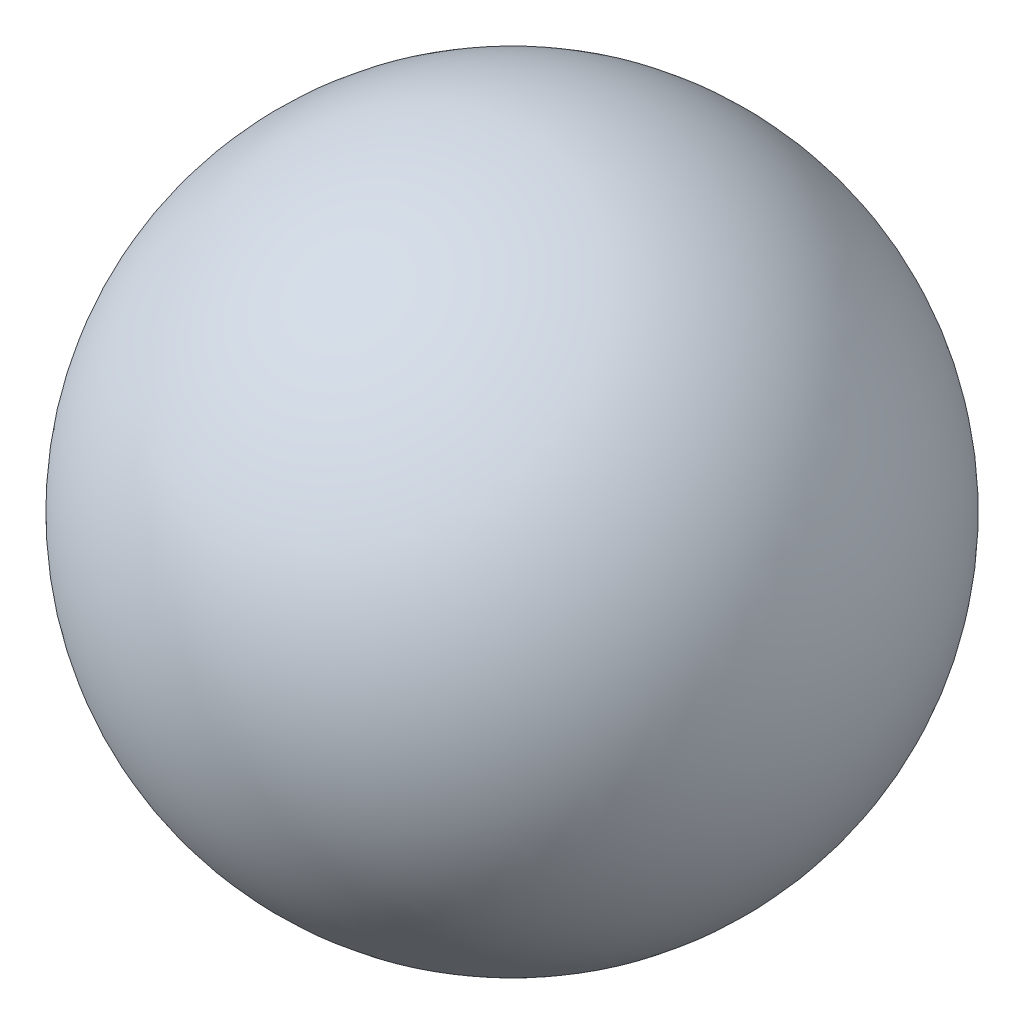
ISO-10303-21;
HEADER;
FILE_DESCRIPTION(('STEP AP214'),'2;1');
FILE_NAME('part.step','',(''),(''),'','','');
FILE_SCHEMA(('AUTOMOTIVE_DESIGN { 1 0 10303 214 1 1 1 1 }'));
ENDSEC;
DATA;
#1=APPLICATION_CONTEXT('core data for automotive mechanical design processes');
#2=APPLICATION_PROTOCOL_DEFINITION('international standard','automotive_design',2000,#1);
#3=PRODUCT_CONTEXT('',#1,'mechanical');
#4=PRODUCT('Part','Part','',(#3));
#5=PRODUCT_RELATED_PRODUCT_CATEGORY('part','',(#4));
#6=PRODUCT_DEFINITION_FORMATION('','',#4);
#7=PRODUCT_DEFINITION_CONTEXT('part definition',#1,'design');
#8=PRODUCT_DEFINITION('design','',#6,#7);
#9=PRODUCT_DEFINITION_SHAPE('','',#8);
#10=(LENGTH_UNIT() NAMED_UNIT(*) SI_UNIT(.MILLI.,.METRE.));
#11=(NAMED_UNIT(*) PLANE_ANGLE_UNIT() SI_UNIT($,.RADIAN.));
#12=(NAMED_UNIT(*) SI_UNIT($,.STERADIAN.) SOLID_ANGLE_UNIT());
#13=UNCERTAINTY_MEASURE_WITH_UNIT(LENGTH_MEASURE(1.E-05),#10,'distance_accuracy_value','');
#14=(GEOMETRIC_REPRESENTATION_CONTEXT(3) GLOBAL_UNCERTAINTY_ASSIGNED_CONTEXT((#13)) GLOBAL_UNIT_ASSIGNED_CONTEXT((#10,
#11,#12)) REPRESENTATION_CONTEXT('',''));
#15=CARTESIAN_POINT('',(0.,0.,0.));
#16=DIRECTION('',(0.,0.,1.));
#17=DIRECTION('',(1.,0.,0.));
#18=AXIS2_PLACEMENT_3D('',#15,#16,#17);
#19=CARTESIAN_POINT('',(0.,0.,0.));
#20=DIRECTION('',(0.,-1.,0.));
#21=DIRECTION('',(0.,0.,1.));
#22=AXIS2_PLACEMENT_3D('',#19,#20,#21);
#23=SPHERICAL_SURFACE('',#22,26.);
#24=CARTESIAN_POINT('',(0.,-26.,0.));
#25=VERTEX_POINT('',#24);
#26=VERTEX_LOOP('',#25);
#27=FACE_BOUND('',#26,.T.);
#28=ADVANCED_FACE('F33',(#27),#23,.T.);
#29=CLOSED_SHELL('',(#28));
#30=MANIFOLD_SOLID_BREP('B2',#29);
#31=ADVANCED_BREP_SHAPE_REPRESENTATION('',(#18,#30),#14);
#32=SHAPE_DEFINITION_REPRESENTATION(#9,#31);
ENDSEC;
END-ISO-10303-21;
